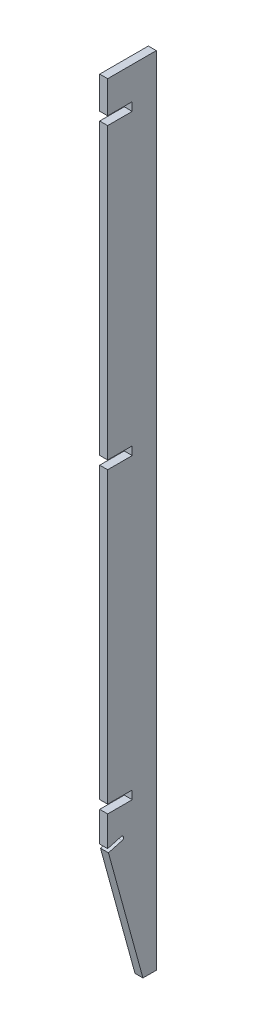
ISO-10303-21;
HEADER;
FILE_DESCRIPTION(('STEP AP214'),'2;1');
FILE_NAME('part.step','',(''),(''),'','','');
FILE_SCHEMA(('AUTOMOTIVE_DESIGN { 1 0 10303 214 1 1 1 1 }'));
ENDSEC;
DATA;
#1=APPLICATION_CONTEXT('core data for automotive mechanical design processes');
#2=APPLICATION_PROTOCOL_DEFINITION('international standard','automotive_design',2000,#1);
#3=PRODUCT_CONTEXT('',#1,'mechanical');
#4=PRODUCT('Part','Part','',(#3));
#5=PRODUCT_RELATED_PRODUCT_CATEGORY('part','',(#4));
#6=PRODUCT_DEFINITION_FORMATION('','',#4);
#7=PRODUCT_DEFINITION_CONTEXT('part definition',#1,'design');
#8=PRODUCT_DEFINITION('design','',#6,#7);
#9=PRODUCT_DEFINITION_SHAPE('','',#8);
#10=(LENGTH_UNIT() NAMED_UNIT(*) SI_UNIT(.MILLI.,.METRE.));
#11=(NAMED_UNIT(*) PLANE_ANGLE_UNIT() SI_UNIT($,.RADIAN.));
#12=(NAMED_UNIT(*) SI_UNIT($,.STERADIAN.) SOLID_ANGLE_UNIT());
#13=UNCERTAINTY_MEASURE_WITH_UNIT(LENGTH_MEASURE(1.E-05),#10,'distance_accuracy_value','');
#14=(GEOMETRIC_REPRESENTATION_CONTEXT(3) GLOBAL_UNCERTAINTY_ASSIGNED_CONTEXT((#13)) GLOBAL_UNIT_ASSIGNED_CONTEXT((#10,
#11,#12)) REPRESENTATION_CONTEXT('',''));
#15=CARTESIAN_POINT('',(0.,0.,0.));
#16=DIRECTION('',(0.,0.,1.));
#17=DIRECTION('',(1.,0.,0.));
#18=AXIS2_PLACEMENT_3D('',#15,#16,#17);
#19=CARTESIAN_POINT('',(-723.646,848.520774128895,76.2));
#20=DIRECTION('',(0.,0.,-1.));
#21=DIRECTION('',(1.,0.,0.));
#22=AXIS2_PLACEMENT_3D('',#19,#20,#21);
#23=PLANE('',#22);
#24=DIRECTION('',(0.,-1.,0.));
#25=VECTOR('',#24,1.);
#26=CARTESIAN_POINT('',(-723.646,848.520774128895,76.2));
#27=LINE('',#26,#25);
#28=CARTESIAN_POINT('',(-723.646,374.269,76.2));
#29=VERTEX_POINT('',#28);
#30=CARTESIAN_POINT('',(-723.646,327.142454536111,76.2));
#31=VERTEX_POINT('',#30);
#32=EDGE_CURVE('E304',#29,#31,#27,.T.);
#33=ORIENTED_EDGE('',*,*,#32,.T.);
#34=DIRECTION('',(1.,0.,0.));
#35=VECTOR('',#34,1.);
#36=CARTESIAN_POINT('',(-723.646,327.142454536111,76.2));
#37=LINE('',#36,#35);
#38=CARTESIAN_POINT('',(-711.2,327.142454536111,76.2));
#39=VERTEX_POINT('',#38);
#40=EDGE_CURVE('E387',#31,#39,#37,.T.);
#41=ORIENTED_EDGE('',*,*,#40,.T.);
#42=DIRECTION('',(0.,-1.,0.));
#43=VECTOR('',#42,1.);
#44=CARTESIAN_POINT('',(-711.2,848.520774128895,76.2));
#45=LINE('',#44,#43);
#46=CARTESIAN_POINT('',(-711.2,374.269,76.2));
#47=VERTEX_POINT('',#46);
#48=EDGE_CURVE('E288',#47,#39,#45,.T.);
#49=ORIENTED_EDGE('',*,*,#48,.F.);
#50=DIRECTION('',(1.,0.,0.));
#51=VECTOR('',#50,1.);
#52=CARTESIAN_POINT('',(-723.646,374.269,76.2));
#53=LINE('',#52,#51);
#54=EDGE_CURVE('E316',#29,#47,#53,.T.);
#55=ORIENTED_EDGE('',*,*,#54,.F.);
#56=EDGE_LOOP('',(#33,#41,#49,#55));
#57=FACE_BOUND('',#56,.T.);
#58=ADVANCED_FACE('F16',(#57),#23,.F.);
#59=DIRECTION('',(-1.,0.,0.));
#60=VECTOR('',#59,1.);
#61=CARTESIAN_POINT('',(-723.646,387.477,76.2));
#62=LINE('',#61,#60);
#63=CARTESIAN_POINT('',(-711.2,387.477,76.2));
#64=VERTEX_POINT('',#63);
#65=CARTESIAN_POINT('',(-723.646,387.477,76.2));
#66=VERTEX_POINT('',#65);
#67=EDGE_CURVE('E323',#64,#66,#62,.T.);
#68=ORIENTED_EDGE('',*,*,#67,.F.);
#69=CARTESIAN_POINT('',(-711.2,841.121,76.2));
#70=VERTEX_POINT('',#69);
#71=EDGE_CURVE('E438',#70,#64,#45,.T.);
#72=ORIENTED_EDGE('',*,*,#71,.F.);
#73=DIRECTION('',(1.,0.,0.));
#74=VECTOR('',#73,1.);
#75=CARTESIAN_POINT('',(-723.646,841.121,76.2));
#76=LINE('',#75,#74);
#77=CARTESIAN_POINT('',(-723.646,841.121,76.2));
#78=VERTEX_POINT('',#77);
#79=EDGE_CURVE('E330',#78,#70,#76,.T.);
#80=ORIENTED_EDGE('',*,*,#79,.F.);
#81=EDGE_CURVE('E458',#78,#66,#27,.T.);
#82=ORIENTED_EDGE('',*,*,#81,.T.);
#83=EDGE_LOOP('',(#68,#72,#80,#82));
#84=FACE_BOUND('',#83,.T.);
#85=ADVANCED_FACE('F476',(#84),#23,.F.);
#86=DIRECTION('',(-1.,0.,0.));
#87=VECTOR('',#86,1.);
#88=CARTESIAN_POINT('',(-723.646,854.329,76.2));
#89=LINE('',#88,#87);
#90=CARTESIAN_POINT('',(-711.2,854.329,76.2));
#91=VERTEX_POINT('',#90);
#92=CARTESIAN_POINT('',(-723.646,854.329,76.2));
#93=VERTEX_POINT('',#92);
#94=EDGE_CURVE('E337',#91,#93,#89,.T.);
#95=ORIENTED_EDGE('',*,*,#94,.F.);
#96=CARTESIAN_POINT('',(-711.2,1307.973,76.2));
#97=VERTEX_POINT('',#96);
#98=EDGE_CURVE('E287',#97,#91,#45,.T.);
#99=ORIENTED_EDGE('',*,*,#98,.F.);
#100=DIRECTION('',(1.,0.,0.));
#101=VECTOR('',#100,1.);
#102=CARTESIAN_POINT('',(-723.646,1307.973,76.2));
#103=LINE('',#102,#101);
#104=CARTESIAN_POINT('',(-723.646,1307.973,76.2));
#105=VERTEX_POINT('',#104);
#106=EDGE_CURVE('E347',#105,#97,#103,.T.);
#107=ORIENTED_EDGE('',*,*,#106,.F.);
#108=EDGE_CURVE('E303',#105,#93,#27,.T.);
#109=ORIENTED_EDGE('',*,*,#108,.T.);
#110=EDGE_LOOP('',(#95,#99,#107,#109));
#111=FACE_BOUND('',#110,.T.);
#112=ADVANCED_FACE('F435',(#111),#23,.F.);
#113=DIRECTION('',(-1.,0.,0.));
#114=VECTOR('',#113,1.);
#115=CARTESIAN_POINT('',(-723.646,1321.181,76.2));
#116=LINE('',#115,#114);
#117=CARTESIAN_POINT('',(-711.2,1321.181,76.2));
#118=VERTEX_POINT('',#117);
#119=CARTESIAN_POINT('',(-723.646,1321.181,76.2));
#120=VERTEX_POINT('',#119);
#121=EDGE_CURVE('E354',#118,#120,#116,.T.);
#122=ORIENTED_EDGE('',*,*,#121,.F.);
#123=CARTESIAN_POINT('',(-711.2,1371.6,76.2));
#124=VERTEX_POINT('',#123);
#125=EDGE_CURVE('E283',#124,#118,#45,.T.);
#126=ORIENTED_EDGE('',*,*,#125,.F.);
#127=DIRECTION('',(1.,0.,0.));
#128=VECTOR('',#127,1.);
#129=CARTESIAN_POINT('',(-723.646,1371.6,76.2));
#130=LINE('',#129,#128);
#131=CARTESIAN_POINT('',(-723.646,1371.6,76.2));
#132=VERTEX_POINT('',#131);
#133=EDGE_CURVE('E274',#132,#124,#130,.T.);
#134=ORIENTED_EDGE('',*,*,#133,.F.);
#135=EDGE_CURVE('E299',#132,#120,#27,.T.);
#136=ORIENTED_EDGE('',*,*,#135,.T.);
#137=EDGE_LOOP('',(#122,#126,#134,#136));
#138=FACE_BOUND('',#137,.T.);
#139=ADVANCED_FACE('F418',(#138),#23,.F.);
#140=CARTESIAN_POINT('',(-723.646,709.727916986039,38.1));
#141=DIRECTION('',(-1.,0.,0.));
#142=DIRECTION('',(0.,1.,0.));
#143=AXIS2_PLACEMENT_3D('',#140,#141,#142);
#144=PLANE('',#143);
#145=DIRECTION('',(0.,0.26471698178117,-0.964326147917118));
#146=VECTOR('',#145,1.);
#147=CARTESIAN_POINT('',(-723.646,363.678082222985,-56.8940722878975));
#148=LINE('',#147,#146);
#149=CARTESIAN_POINT('',(-723.646,332.906598311917,55.2020476738473));
#150=VERTEX_POINT('',#149);
#151=EDGE_CURVE('E366',#31,#150,#148,.T.);
#152=ORIENTED_EDGE('',*,*,#151,.F.);
#153=ORIENTED_EDGE('',*,*,#32,.F.);
#154=DIRECTION('',(0.,0.,-1.));
#155=VECTOR('',#154,1.);
#156=CARTESIAN_POINT('',(-723.646,374.269,38.1));
#157=LINE('',#156,#155);
#158=CARTESIAN_POINT('',(-723.646,374.269,37.719));
#159=VERTEX_POINT('',#158);
#160=EDGE_CURVE('E312',#29,#159,#157,.T.);
#161=ORIENTED_EDGE('',*,*,#160,.T.);
#162=DIRECTION('',(0.,-1.,0.));
#163=VECTOR('',#162,1.);
#164=CARTESIAN_POINT('',(-723.646,709.727916986039,37.719));
#165=LINE('',#164,#163);
#166=CARTESIAN_POINT('',(-723.646,387.477,37.719));
#167=VERTEX_POINT('',#166);
#168=EDGE_CURVE('E296',#167,#159,#165,.T.);
#169=ORIENTED_EDGE('',*,*,#168,.F.);
#170=DIRECTION('',(0.,0.,1.));
#171=VECTOR('',#170,1.);
#172=CARTESIAN_POINT('',(-723.646,387.477,38.1));
#173=LINE('',#172,#171);
#174=EDGE_CURVE('E319',#167,#66,#173,.T.);
#175=ORIENTED_EDGE('',*,*,#174,.T.);
#176=ORIENTED_EDGE('',*,*,#81,.F.);
#177=DIRECTION('',(0.,0.,-1.));
#178=VECTOR('',#177,1.);
#179=CARTESIAN_POINT('',(-723.646,841.121,38.1));
#180=LINE('',#179,#178);
#181=CARTESIAN_POINT('',(-723.646,841.121,37.719));
#182=VERTEX_POINT('',#181);
#183=EDGE_CURVE('E326',#78,#182,#180,.T.);
#184=ORIENTED_EDGE('',*,*,#183,.T.);
#185=DIRECTION('',(0.,-1.,0.));
#186=VECTOR('',#185,1.);
#187=CARTESIAN_POINT('',(-723.646,709.727916986039,37.719));
#188=LINE('',#187,#186);
#189=CARTESIAN_POINT('',(-723.646,854.329,37.719));
#190=VERTEX_POINT('',#189);
#191=EDGE_CURVE('E340',#190,#182,#188,.T.);
#192=ORIENTED_EDGE('',*,*,#191,.F.);
#193=DIRECTION('',(0.,0.,1.));
#194=VECTOR('',#193,1.);
#195=CARTESIAN_POINT('',(-723.646,854.329,38.1));
#196=LINE('',#195,#194);
#197=EDGE_CURVE('E333',#190,#93,#196,.T.);
#198=ORIENTED_EDGE('',*,*,#197,.T.);
#199=ORIENTED_EDGE('',*,*,#108,.F.);
#200=DIRECTION('',(0.,0.,-1.));
#201=VECTOR('',#200,1.);
#202=CARTESIAN_POINT('',(-723.646,1307.973,38.1));
#203=LINE('',#202,#201);
#204=CARTESIAN_POINT('',(-723.646,1307.973,37.719));
#205=VERTEX_POINT('',#204);
#206=EDGE_CURVE('E343',#105,#205,#203,.T.);
#207=ORIENTED_EDGE('',*,*,#206,.T.);
#208=DIRECTION('',(0.,-1.,0.));
#209=VECTOR('',#208,1.);
#210=CARTESIAN_POINT('',(-723.646,709.727916986039,37.719));
#211=LINE('',#210,#209);
#212=CARTESIAN_POINT('',(-723.646,1321.181,37.719));
#213=VERTEX_POINT('',#212);
#214=EDGE_CURVE('E357',#213,#205,#211,.T.);
#215=ORIENTED_EDGE('',*,*,#214,.F.);
#216=DIRECTION('',(0.,0.,1.));
#217=VECTOR('',#216,1.);
#218=CARTESIAN_POINT('',(-723.646,1321.181,38.1));
#219=LINE('',#218,#217);
#220=EDGE_CURVE('E350',#213,#120,#219,.T.);
#221=ORIENTED_EDGE('',*,*,#220,.T.);
#222=ORIENTED_EDGE('',*,*,#135,.F.);
#223=DIRECTION('',(0.,0.,1.));
#224=VECTOR('',#223,1.);
#225=CARTESIAN_POINT('',(-723.646,1371.6,38.1));
#226=LINE('',#225,#224);
#227=CARTESIAN_POINT('',(-723.646,1371.6,0.));
#228=VERTEX_POINT('',#227);
#229=EDGE_CURVE('E305',#228,#132,#226,.T.);
#230=ORIENTED_EDGE('',*,*,#229,.F.);
#231=DIRECTION('',(0.,-1.,0.));
#232=VECTOR('',#231,1.);
#233=CARTESIAN_POINT('',(-723.646,709.727916986039,1.196959198424E-13));
#234=LINE('',#233,#232);
#235=CARTESIAN_POINT('',(-723.646,124.055833972076,2.25611489484112E-13));
#236=VERTEX_POINT('',#235);
#237=EDGE_CURVE('E282',#228,#236,#234,.T.);
#238=ORIENTED_EDGE('',*,*,#237,.T.);
#239=DIRECTION('',(0.,0.,1.));
#240=VECTOR('',#239,1.);
#241=CARTESIAN_POINT('',(-723.646,124.055833972077,38.1000000000125));
#242=LINE('',#241,#240);
#243=CARTESIAN_POINT('',(-723.646,124.055833972077,20.9176470588238));
#244=VERTEX_POINT('',#243);
#245=EDGE_CURVE('E207',#236,#244,#242,.T.);
#246=ORIENTED_EDGE('',*,*,#245,.T.);
#247=DIRECTION('',(0.,-0.964326147917118,-0.26471698178117));
#248=VECTOR('',#247,1.);
#249=CARTESIAN_POINT('',(-723.646,186.648691114934,38.1));
#250=LINE('',#249,#248);
#251=CARTESIAN_POINT('',(-723.646,320.899792352557,74.9532434769948));
#252=VERTEX_POINT('',#251);
#253=EDGE_CURVE('E278',#252,#244,#250,.T.);
#254=ORIENTED_EDGE('',*,*,#253,.F.);
#255=DIRECTION('',(0.,0.26471698178117,-0.964326147917118));
#256=VECTOR('',#255,1.);
#257=CARTESIAN_POINT('',(-723.646,357.554611183711,-58.5750251222078));
#258=LINE('',#257,#256);
#259=CARTESIAN_POINT('',(-723.646,326.783127272644,53.5210948395368));
#260=VERTEX_POINT('',#259);
#261=EDGE_CURVE('E393',#252,#260,#258,.T.);
#262=ORIENTED_EDGE('',*,*,#261,.T.);
#263=CARTESIAN_POINT('',(-723.646,329.844862792281,54.361571256692));
#264=DIRECTION('',(-1.,0.,0.));
#265=DIRECTION('',(0.,-1.,0.));
#266=AXIS2_PLACEMENT_3D('',#263,#264,#265);
#267=CIRCLE('',#266,3.175);
#268=EDGE_CURVE('E214',#150,#260,#267,.T.);
#269=ORIENTED_EDGE('',*,*,#268,.F.);
#270=EDGE_LOOP('',(#152,#153,#161,#169,#175,#176,#184,#192,#198,#199,#207,#215,#221,#222,#230,
#238,#246,#254,#262,#269));
#271=FACE_BOUND('',#270,.T.);
#272=ADVANCED_FACE('F404',(#271),#144,.T.);
#273=CARTESIAN_POINT('',(-711.2,709.727916986039,38.1));
#274=DIRECTION('',(-1.,0.,0.));
#275=DIRECTION('',(0.,1.,0.));
#276=AXIS2_PLACEMENT_3D('',#273,#274,#275);
#277=PLANE('',#276);
#278=ORIENTED_EDGE('',*,*,#48,.T.);
#279=DIRECTION('',(0.,0.26471698178117,-0.964326147917118));
#280=VECTOR('',#279,1.);
#281=CARTESIAN_POINT('',(-711.2,363.678082222985,-56.8940722878975));
#282=LINE('',#281,#280);
#283=CARTESIAN_POINT('',(-711.2,332.906598311917,55.2020476738473));
#284=VERTEX_POINT('',#283);
#285=EDGE_CURVE('E11',#39,#284,#282,.T.);
#286=ORIENTED_EDGE('',*,*,#285,.T.);
#287=CARTESIAN_POINT('',(-711.2,329.844862792281,54.361571256692));
#288=DIRECTION('',(-1.,0.,0.));
#289=DIRECTION('',(0.,-1.,0.));
#290=AXIS2_PLACEMENT_3D('',#287,#288,#289);
#291=CIRCLE('',#290,3.175);
#292=CARTESIAN_POINT('',(-711.2,326.783127272644,53.5210948395368));
#293=VERTEX_POINT('',#292);
#294=EDGE_CURVE('E25',#284,#293,#291,.T.);
#295=ORIENTED_EDGE('',*,*,#294,.T.);
#296=DIRECTION('',(0.,0.26471698178117,-0.964326147917118));
#297=VECTOR('',#296,1.);
#298=CARTESIAN_POINT('',(-711.2,357.554611183711,-58.5750251222078));
#299=LINE('',#298,#297);
#300=CARTESIAN_POINT('',(-711.2,320.899792352557,74.9532434769949));
#301=VERTEX_POINT('',#300);
#302=EDGE_CURVE('E198',#301,#293,#299,.T.);
#303=ORIENTED_EDGE('',*,*,#302,.F.);
#304=DIRECTION('',(0.,-0.964326147917118,-0.26471698178117));
#305=VECTOR('',#304,1.);
#306=CARTESIAN_POINT('',(-711.2,186.648691114934,38.1));
#307=LINE('',#306,#305);
#308=CARTESIAN_POINT('',(-711.2,124.055833972077,20.9176470588238));
#309=VERTEX_POINT('',#308);
#310=EDGE_CURVE('E279',#301,#309,#307,.T.);
#311=ORIENTED_EDGE('',*,*,#310,.T.);
#312=DIRECTION('',(0.,0.,-1.));
#313=VECTOR('',#312,1.);
#314=CARTESIAN_POINT('',(-711.2,124.055833972077,20.9176470588238));
#315=LINE('',#314,#313);
#316=CARTESIAN_POINT('',(-711.2,124.055833972076,2.25611489484112E-13));
#317=VERTEX_POINT('',#316);
#318=EDGE_CURVE('E231',#309,#317,#315,.T.);
#319=ORIENTED_EDGE('',*,*,#318,.T.);
#320=DIRECTION('',(0.,-1.,0.));
#321=VECTOR('',#320,1.);
#322=CARTESIAN_POINT('',(-711.2,709.727916986039,1.196959198424E-13));
#323=LINE('',#322,#321);
#324=CARTESIAN_POINT('',(-711.2,1371.6,0.));
#325=VERTEX_POINT('',#324);
#326=EDGE_CURVE('E293',#325,#317,#323,.T.);
#327=ORIENTED_EDGE('',*,*,#326,.F.);
#328=DIRECTION('',(0.,0.,1.));
#329=VECTOR('',#328,1.);
#330=CARTESIAN_POINT('',(-711.2,1371.6,38.1));
#331=LINE('',#330,#329);
#332=EDGE_CURVE('E289',#325,#124,#331,.T.);
#333=ORIENTED_EDGE('',*,*,#332,.T.);
#334=ORIENTED_EDGE('',*,*,#125,.T.);
#335=DIRECTION('',(0.,0.,1.));
#336=VECTOR('',#335,1.);
#337=CARTESIAN_POINT('',(-711.2,1321.181,38.1));
#338=LINE('',#337,#336);
#339=CARTESIAN_POINT('',(-711.2,1321.181,37.719));
#340=VERTEX_POINT('',#339);
#341=EDGE_CURVE('E263',#340,#118,#338,.T.);
#342=ORIENTED_EDGE('',*,*,#341,.F.);
#343=DIRECTION('',(0.,-1.,0.));
#344=VECTOR('',#343,1.);
#345=CARTESIAN_POINT('',(-711.2,709.727916986039,37.719));
#346=LINE('',#345,#344);
#347=CARTESIAN_POINT('',(-711.2,1307.973,37.719));
#348=VERTEX_POINT('',#347);
#349=EDGE_CURVE('E266',#340,#348,#346,.T.);
#350=ORIENTED_EDGE('',*,*,#349,.T.);
#351=DIRECTION('',(0.,0.,-1.));
#352=VECTOR('',#351,1.);
#353=CARTESIAN_POINT('',(-711.2,1307.973,38.1));
#354=LINE('',#353,#352);
#355=EDGE_CURVE('E259',#97,#348,#354,.T.);
#356=ORIENTED_EDGE('',*,*,#355,.F.);
#357=ORIENTED_EDGE('',*,*,#98,.T.);
#358=DIRECTION('',(0.,0.,1.));
#359=VECTOR('',#358,1.);
#360=CARTESIAN_POINT('',(-711.2,854.329,38.1));
#361=LINE('',#360,#359);
#362=CARTESIAN_POINT('',(-711.2,854.329,37.719));
#363=VERTEX_POINT('',#362);
#364=EDGE_CURVE('E252',#363,#91,#361,.T.);
#365=ORIENTED_EDGE('',*,*,#364,.F.);
#366=DIRECTION('',(0.,-1.,0.));
#367=VECTOR('',#366,1.);
#368=CARTESIAN_POINT('',(-711.2,709.727916986039,37.719));
#369=LINE('',#368,#367);
#370=CARTESIAN_POINT('',(-711.2,841.121,37.719));
#371=VERTEX_POINT('',#370);
#372=EDGE_CURVE('E255',#363,#371,#369,.T.);
#373=ORIENTED_EDGE('',*,*,#372,.T.);
#374=DIRECTION('',(0.,0.,-1.));
#375=VECTOR('',#374,1.);
#376=CARTESIAN_POINT('',(-711.2,841.121,38.1));
#377=LINE('',#376,#375);
#378=EDGE_CURVE('E248',#70,#371,#377,.T.);
#379=ORIENTED_EDGE('',*,*,#378,.F.);
#380=ORIENTED_EDGE('',*,*,#71,.T.);
#381=DIRECTION('',(0.,0.,1.));
#382=VECTOR('',#381,1.);
#383=CARTESIAN_POINT('',(-711.2,387.477,38.1));
#384=LINE('',#383,#382);
#385=CARTESIAN_POINT('',(-711.2,387.477,37.719));
#386=VERTEX_POINT('',#385);
#387=EDGE_CURVE('E245',#386,#64,#384,.T.);
#388=ORIENTED_EDGE('',*,*,#387,.F.);
#389=DIRECTION('',(0.,-1.,0.));
#390=VECTOR('',#389,1.);
#391=CARTESIAN_POINT('',(-711.2,709.727916986039,37.719));
#392=LINE('',#391,#390);
#393=CARTESIAN_POINT('',(-711.2,374.269,37.719));
#394=VERTEX_POINT('',#393);
#395=EDGE_CURVE('E241',#386,#394,#392,.T.);
#396=ORIENTED_EDGE('',*,*,#395,.T.);
#397=DIRECTION('',(0.,0.,-1.));
#398=VECTOR('',#397,1.);
#399=CARTESIAN_POINT('',(-711.2,374.269,38.1));
#400=LINE('',#399,#398);
#401=EDGE_CURVE('E238',#47,#394,#400,.T.);
#402=ORIENTED_EDGE('',*,*,#401,.F.);
#403=EDGE_LOOP('',(#278,#286,#295,#303,#311,#319,#327,#333,#334,#342,#350,#356,#357,#365,#373,
#379,#380,#388,#396,#402));
#404=FACE_BOUND('',#403,.T.);
#405=ADVANCED_FACE('F219',(#404),#277,.F.);
#406=CARTESIAN_POINT('',(-723.646,709.727916986039,1.196959198424E-13));
#407=DIRECTION('',(0.,0.,-1.));
#408=DIRECTION('',(0.,1.,0.));
#409=AXIS2_PLACEMENT_3D('',#406,#407,#408);
#410=PLANE('',#409);
#411=ORIENTED_EDGE('',*,*,#326,.T.);
#412=DIRECTION('',(-1.,0.,0.));
#413=VECTOR('',#412,1.);
#414=CARTESIAN_POINT('',(-723.646,124.055833972076,2.25611489484112E-13));
#415=LINE('',#414,#413);
#416=EDGE_CURVE('E49',#317,#236,#415,.T.);
#417=ORIENTED_EDGE('',*,*,#416,.T.);
#418=ORIENTED_EDGE('',*,*,#237,.F.);
#419=DIRECTION('',(1.,0.,0.));
#420=VECTOR('',#419,1.);
#421=CARTESIAN_POINT('',(-723.646,1371.6,0.));
#422=LINE('',#421,#420);
#423=EDGE_CURVE('E270',#228,#325,#422,.T.);
#424=ORIENTED_EDGE('',*,*,#423,.T.);
#425=EDGE_LOOP('',(#411,#417,#418,#424));
#426=FACE_BOUND('',#425,.T.);
#427=ADVANCED_FACE('F410',(#426),#410,.T.);
#428=CARTESIAN_POINT('',(-723.646,1371.6,38.1));
#429=DIRECTION('',(0.,-1.,0.));
#430=DIRECTION('',(-1.,0.,0.));
#431=AXIS2_PLACEMENT_3D('',#428,#429,#430);
#432=PLANE('',#431);
#433=ORIENTED_EDGE('',*,*,#332,.F.);
#434=ORIENTED_EDGE('',*,*,#423,.F.);
#435=ORIENTED_EDGE('',*,*,#229,.T.);
#436=ORIENTED_EDGE('',*,*,#133,.T.);
#437=EDGE_LOOP('',(#433,#434,#435,#436));
#438=FACE_BOUND('',#437,.T.);
#439=ADVANCED_FACE('F413',(#438),#432,.F.);
#440=CARTESIAN_POINT('',(-723.646,186.648691114934,38.1));
#441=DIRECTION('',(0.,0.26471698178117,-0.964326147917118));
#442=DIRECTION('',(0.,0.964326147917118,0.26471698178117));
#443=AXIS2_PLACEMENT_3D('',#440,#441,#442);
#444=PLANE('',#443);
#445=ORIENTED_EDGE('',*,*,#310,.F.);
#446=DIRECTION('',(-1.,0.,0.));
#447=VECTOR('',#446,1.);
#448=CARTESIAN_POINT('',(2294.93415908109,320.899792352557,74.9532434769948));
#449=LINE('',#448,#447);
#450=EDGE_CURVE('E37',#301,#252,#449,.T.);
#451=ORIENTED_EDGE('',*,*,#450,.T.);
#452=ORIENTED_EDGE('',*,*,#253,.T.);
#453=DIRECTION('',(1.,0.,0.));
#454=VECTOR('',#453,1.);
#455=CARTESIAN_POINT('',(-711.2,124.055833972077,20.9176470588238));
#456=LINE('',#455,#454);
#457=EDGE_CURVE('E234',#244,#309,#456,.T.);
#458=ORIENTED_EDGE('',*,*,#457,.T.);
#459=EDGE_LOOP('',(#445,#451,#452,#458));
#460=FACE_BOUND('',#459,.T.);
#461=ADVANCED_FACE('F401',(#460),#444,.F.);
#462=CARTESIAN_POINT('',(2295.26058781173,847.725,37.719));
#463=DIRECTION('',(0.,0.,-1.));
#464=DIRECTION('',(-1.,0.,0.));
#465=AXIS2_PLACEMENT_3D('',#462,#463,#464);
#466=PLANE('',#465);
#467=ORIENTED_EDGE('',*,*,#214,.T.);
#468=DIRECTION('',(-1.,0.,0.));
#469=VECTOR('',#468,1.);
#470=CARTESIAN_POINT('',(2295.26058781173,1307.973,37.719));
#471=LINE('',#470,#469);
#472=EDGE_CURVE('E361',#348,#205,#471,.T.);
#473=ORIENTED_EDGE('',*,*,#472,.F.);
#474=ORIENTED_EDGE('',*,*,#349,.F.);
#475=DIRECTION('',(-1.,0.,0.));
#476=VECTOR('',#475,1.);
#477=CARTESIAN_POINT('',(2295.26058781173,1321.181,37.719));
#478=LINE('',#477,#476);
#479=EDGE_CURVE('E365',#340,#213,#478,.T.);
#480=ORIENTED_EDGE('',*,*,#479,.T.);
#481=EDGE_LOOP('',(#467,#473,#474,#480));
#482=FACE_BOUND('',#481,.T.);
#483=ADVANCED_FACE('F425',(#482),#466,.F.);
#484=CARTESIAN_POINT('',(2295.26058781173,1307.973,38.1));
#485=DIRECTION('',(0.,1.,0.));
#486=DIRECTION('',(-1.,0.,0.));
#487=AXIS2_PLACEMENT_3D('',#484,#485,#486);
#488=PLANE('',#487);
#489=ORIENTED_EDGE('',*,*,#106,.T.);
#490=ORIENTED_EDGE('',*,*,#355,.T.);
#491=ORIENTED_EDGE('',*,*,#472,.T.);
#492=ORIENTED_EDGE('',*,*,#206,.F.);
#493=EDGE_LOOP('',(#489,#490,#491,#492));
#494=FACE_BOUND('',#493,.T.);
#495=ADVANCED_FACE('F427',(#494),#488,.T.);
#496=CARTESIAN_POINT('',(2295.26058781173,1321.181,38.1));
#497=DIRECTION('',(0.,-1.,0.));
#498=DIRECTION('',(1.,0.,0.));
#499=AXIS2_PLACEMENT_3D('',#496,#497,#498);
#500=PLANE('',#499);
#501=ORIENTED_EDGE('',*,*,#479,.F.);
#502=ORIENTED_EDGE('',*,*,#341,.T.);
#503=ORIENTED_EDGE('',*,*,#121,.T.);
#504=ORIENTED_EDGE('',*,*,#220,.F.);
#505=EDGE_LOOP('',(#501,#502,#503,#504));
#506=FACE_BOUND('',#505,.T.);
#507=ADVANCED_FACE('F421',(#506),#500,.T.);
#508=CARTESIAN_POINT('',(2295.26058781173,847.725,37.719));
#509=DIRECTION('',(0.,0.,-1.));
#510=DIRECTION('',(-1.,0.,0.));
#511=AXIS2_PLACEMENT_3D('',#508,#509,#510);
#512=PLANE('',#511);
#513=ORIENTED_EDGE('',*,*,#191,.T.);
#514=DIRECTION('',(-1.,0.,0.));
#515=VECTOR('',#514,1.);
#516=CARTESIAN_POINT('',(2295.26058781173,841.121,37.719));
#517=LINE('',#516,#515);
#518=EDGE_CURVE('E370',#371,#182,#517,.T.);
#519=ORIENTED_EDGE('',*,*,#518,.F.);
#520=ORIENTED_EDGE('',*,*,#372,.F.);
#521=DIRECTION('',(-1.,0.,0.));
#522=VECTOR('',#521,1.);
#523=CARTESIAN_POINT('',(2295.26058781173,854.329,37.719));
#524=LINE('',#523,#522);
#525=EDGE_CURVE('E371',#363,#190,#524,.T.);
#526=ORIENTED_EDGE('',*,*,#525,.T.);
#527=EDGE_LOOP('',(#513,#519,#520,#526));
#528=FACE_BOUND('',#527,.T.);
#529=ADVANCED_FACE('F474',(#528),#512,.F.);
#530=CARTESIAN_POINT('',(2295.26058781173,841.121,38.1));
#531=DIRECTION('',(0.,1.,0.));
#532=DIRECTION('',(-1.,0.,0.));
#533=AXIS2_PLACEMENT_3D('',#530,#531,#532);
#534=PLANE('',#533);
#535=ORIENTED_EDGE('',*,*,#79,.T.);
#536=ORIENTED_EDGE('',*,*,#378,.T.);
#537=ORIENTED_EDGE('',*,*,#518,.T.);
#538=ORIENTED_EDGE('',*,*,#183,.F.);
#539=EDGE_LOOP('',(#535,#536,#537,#538));
#540=FACE_BOUND('',#539,.T.);
#541=ADVANCED_FACE('F646',(#540),#534,.T.);
#542=CARTESIAN_POINT('',(2295.26058781173,854.329,38.1));
#543=DIRECTION('',(0.,-1.,0.));
#544=DIRECTION('',(1.,0.,0.));
#545=AXIS2_PLACEMENT_3D('',#542,#543,#544);
#546=PLANE('',#545);
#547=ORIENTED_EDGE('',*,*,#525,.F.);
#548=ORIENTED_EDGE('',*,*,#364,.T.);
#549=ORIENTED_EDGE('',*,*,#94,.T.);
#550=ORIENTED_EDGE('',*,*,#197,.F.);
#551=EDGE_LOOP('',(#547,#548,#549,#550));
#552=FACE_BOUND('',#551,.T.);
#553=ADVANCED_FACE('F472',(#552),#546,.T.);
#554=CARTESIAN_POINT('',(2295.26058781173,847.725,37.719));
#555=DIRECTION('',(0.,0.,-1.));
#556=DIRECTION('',(-1.,0.,0.));
#557=AXIS2_PLACEMENT_3D('',#554,#555,#556);
#558=PLANE('',#557);
#559=ORIENTED_EDGE('',*,*,#168,.T.);
#560=DIRECTION('',(-1.,0.,0.));
#561=VECTOR('',#560,1.);
#562=CARTESIAN_POINT('',(2295.26058781173,374.269,37.719));
#563=LINE('',#562,#561);
#564=EDGE_CURVE('E360',#394,#159,#563,.T.);
#565=ORIENTED_EDGE('',*,*,#564,.F.);
#566=ORIENTED_EDGE('',*,*,#395,.F.);
#567=DIRECTION('',(-1.,0.,0.));
#568=VECTOR('',#567,1.);
#569=CARTESIAN_POINT('',(2295.26058781173,387.477,37.719));
#570=LINE('',#569,#568);
#571=EDGE_CURVE('E375',#386,#167,#570,.T.);
#572=ORIENTED_EDGE('',*,*,#571,.T.);
#573=EDGE_LOOP('',(#559,#565,#566,#572));
#574=FACE_BOUND('',#573,.T.);
#575=ADVANCED_FACE('F481',(#574),#558,.F.);
#576=CARTESIAN_POINT('',(2295.26058781173,374.269,44.45));
#577=DIRECTION('',(0.,1.,0.));
#578=DIRECTION('',(-1.,0.,0.));
#579=AXIS2_PLACEMENT_3D('',#576,#577,#578);
#580=PLANE('',#579);
#581=ORIENTED_EDGE('',*,*,#54,.T.);
#582=ORIENTED_EDGE('',*,*,#401,.T.);
#583=ORIENTED_EDGE('',*,*,#564,.T.);
#584=ORIENTED_EDGE('',*,*,#160,.F.);
#585=EDGE_LOOP('',(#581,#582,#583,#584));
#586=FACE_BOUND('',#585,.T.);
#587=ADVANCED_FACE('F484',(#586),#580,.T.);
#588=CARTESIAN_POINT('',(2295.26058781173,387.477,44.45));
#589=DIRECTION('',(0.,-1.,0.));
#590=DIRECTION('',(1.,0.,0.));
#591=AXIS2_PLACEMENT_3D('',#588,#589,#590);
#592=PLANE('',#591);
#593=ORIENTED_EDGE('',*,*,#571,.F.);
#594=ORIENTED_EDGE('',*,*,#387,.T.);
#595=ORIENTED_EDGE('',*,*,#67,.T.);
#596=ORIENTED_EDGE('',*,*,#174,.F.);
#597=EDGE_LOOP('',(#593,#594,#595,#596));
#598=FACE_BOUND('',#597,.T.);
#599=ADVANCED_FACE('F478',(#598),#592,.T.);
#600=CARTESIAN_POINT('',(-723.646,124.055833972077,20.9176470588238));
#601=DIRECTION('',(0.,-1.,0.));
#602=DIRECTION('',(-1.,0.,0.));
#603=AXIS2_PLACEMENT_3D('',#600,#601,#602);
#604=PLANE('',#603);
#605=ORIENTED_EDGE('',*,*,#245,.F.);
#606=ORIENTED_EDGE('',*,*,#416,.F.);
#607=ORIENTED_EDGE('',*,*,#318,.F.);
#608=ORIENTED_EDGE('',*,*,#457,.F.);
#609=EDGE_LOOP('',(#605,#606,#607,#608));
#610=FACE_BOUND('',#609,.T.);
#611=ADVANCED_FACE('F18',(#610),#604,.T.);
#612=CARTESIAN_POINT('',(2294.93415908109,329.844862792281,54.361571256692));
#613=DIRECTION('',(-1.,0.,0.));
#614=DIRECTION('',(0.,-1.,0.));
#615=AXIS2_PLACEMENT_3D('',#612,#613,#614);
#616=CYLINDRICAL_SURFACE('',#615,3.175);
#617=ORIENTED_EDGE('',*,*,#268,.T.);
#618=DIRECTION('',(-1.,0.,0.));
#619=VECTOR('',#618,1.);
#620=CARTESIAN_POINT('',(2294.93415908109,326.783127272644,53.5210948395368));
#621=LINE('',#620,#619);
#622=EDGE_CURVE('E201',#293,#260,#621,.T.);
#623=ORIENTED_EDGE('',*,*,#622,.F.);
#624=ORIENTED_EDGE('',*,*,#294,.F.);
#625=DIRECTION('',(-1.,0.,0.));
#626=VECTOR('',#625,1.);
#627=CARTESIAN_POINT('',(2294.93415908109,332.906598311918,55.2020476738473));
#628=LINE('',#627,#626);
#629=EDGE_CURVE('E216',#284,#150,#628,.T.);
#630=ORIENTED_EDGE('',*,*,#629,.T.);
#631=EDGE_LOOP('',(#617,#623,#624,#630));
#632=FACE_BOUND('',#631,.T.);
#633=ADVANCED_FACE('F210',(#632),#616,.F.);
#634=CARTESIAN_POINT('',(2294.93415908109,323.930746269763,63.9119113500311));
#635=DIRECTION('',(0.,0.964326147917118,0.26471698178117));
#636=DIRECTION('',(0.,-0.26471698178117,0.964326147917118));
#637=AXIS2_PLACEMENT_3D('',#634,#635,#636);
#638=PLANE('',#637);
#639=ORIENTED_EDGE('',*,*,#450,.F.);
#640=ORIENTED_EDGE('',*,*,#302,.T.);
#641=ORIENTED_EDGE('',*,*,#622,.T.);
#642=ORIENTED_EDGE('',*,*,#261,.F.);
#643=EDGE_LOOP('',(#639,#640,#641,#642));
#644=FACE_BOUND('',#643,.T.);
#645=ADVANCED_FACE('F200',(#644),#638,.T.);
#646=CARTESIAN_POINT('',(2294.93415908109,330.049233053331,65.6110211158403));
#647=DIRECTION('',(0.,0.964326147917118,0.26471698178117));
#648=DIRECTION('',(0.,-0.26471698178117,0.964326147917118));
#649=AXIS2_PLACEMENT_3D('',#646,#647,#648);
#650=PLANE('',#649);
#651=ORIENTED_EDGE('',*,*,#151,.T.);
#652=ORIENTED_EDGE('',*,*,#629,.F.);
#653=ORIENTED_EDGE('',*,*,#285,.F.);
#654=ORIENTED_EDGE('',*,*,#40,.F.);
#655=EDGE_LOOP('',(#651,#652,#653,#654));
#656=FACE_BOUND('',#655,.T.);
#657=ADVANCED_FACE('F455',(#656),#650,.F.);
#658=CLOSED_SHELL('',(#58,#85,#112,#139,#272,#405,#427,#439,#461,#483,#495,#507,#529,#541,#553,
#575,#587,#599,#611,#633,#645,#657));
#659=MANIFOLD_SOLID_BREP('B1',#658);
#660=ADVANCED_BREP_SHAPE_REPRESENTATION('',(#18,#659),#14);
#661=SHAPE_DEFINITION_REPRESENTATION(#9,#660);
ENDSEC;
END-ISO-10303-21;
